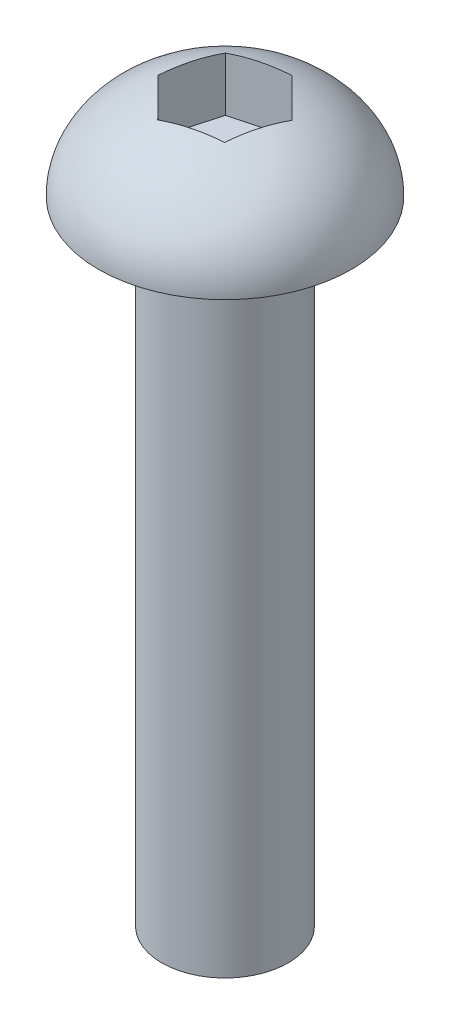
ISO-10303-21;
HEADER;
FILE_DESCRIPTION(('STEP AP214'),'2;1');
FILE_NAME('part.step','',(''),(''),'','','');
FILE_SCHEMA(('AUTOMOTIVE_DESIGN { 1 0 10303 214 1 1 1 1 }'));
ENDSEC;
DATA;
#1=APPLICATION_CONTEXT('core data for automotive mechanical design processes');
#2=APPLICATION_PROTOCOL_DEFINITION('international standard','automotive_design',2000,#1);
#3=PRODUCT_CONTEXT('',#1,'mechanical');
#4=PRODUCT('Part','Part','',(#3));
#5=PRODUCT_RELATED_PRODUCT_CATEGORY('part','',(#4));
#6=PRODUCT_DEFINITION_FORMATION('','',#4);
#7=PRODUCT_DEFINITION_CONTEXT('part definition',#1,'design');
#8=PRODUCT_DEFINITION('design','',#6,#7);
#9=PRODUCT_DEFINITION_SHAPE('','',#8);
#10=(LENGTH_UNIT() NAMED_UNIT(*) SI_UNIT(.MILLI.,.METRE.));
#11=(NAMED_UNIT(*) PLANE_ANGLE_UNIT() SI_UNIT($,.RADIAN.));
#12=(NAMED_UNIT(*) SI_UNIT($,.STERADIAN.) SOLID_ANGLE_UNIT());
#13=UNCERTAINTY_MEASURE_WITH_UNIT(LENGTH_MEASURE(1.E-05),#10,'distance_accuracy_value','');
#14=(GEOMETRIC_REPRESENTATION_CONTEXT(3) GLOBAL_UNCERTAINTY_ASSIGNED_CONTEXT((#13)) GLOBAL_UNIT_ASSIGNED_CONTEXT((#10,
#11,#12)) REPRESENTATION_CONTEXT('',''));
#15=CARTESIAN_POINT('',(0.,0.,0.));
#16=DIRECTION('',(0.,0.,1.));
#17=DIRECTION('',(1.,0.,0.));
#18=AXIS2_PLACEMENT_3D('',#15,#16,#17);
#19=CARTESIAN_POINT('',(0.,10.,0.));
#20=DIRECTION('',(0.,-1.,0.));
#21=DIRECTION('',(0.,0.,-1.));
#22=AXIS2_PLACEMENT_3D('',#19,#20,#21);
#23=CYLINDRICAL_SURFACE('',#22,1.);
#24=CARTESIAN_POINT('',(0.,10.,0.));
#25=DIRECTION('',(0.,1.,0.));
#26=DIRECTION('',(0.,0.,1.));
#27=AXIS2_PLACEMENT_3D('',#24,#25,#26);
#28=CIRCLE('',#27,1.);
#29=CARTESIAN_POINT('',(0.,10.,1.));
#30=VERTEX_POINT('',#29);
#31=EDGE_CURVE('E55',#30,#30,#28,.T.);
#32=ORIENTED_EDGE('',*,*,#31,.F.);
#33=EDGE_LOOP('',(#32));
#34=FACE_BOUND('',#33,.T.);
#35=CARTESIAN_POINT('',(0.,0.,0.));
#36=DIRECTION('',(0.,1.,0.));
#37=DIRECTION('',(0.,0.,1.));
#38=AXIS2_PLACEMENT_3D('',#35,#36,#37);
#39=CIRCLE('',#38,1.);
#40=CARTESIAN_POINT('',(0.,0.,1.));
#41=VERTEX_POINT('',#40);
#42=EDGE_CURVE('E131',#41,#41,#39,.T.);
#43=ORIENTED_EDGE('',*,*,#42,.T.);
#44=EDGE_LOOP('',(#43));
#45=FACE_BOUND('',#44,.T.);
#46=ADVANCED_FACE('F41',(#34,#45),#23,.T.);
#47=CARTESIAN_POINT('',(0.,0.,0.));
#48=DIRECTION('',(0.,1.,0.));
#49=DIRECTION('',(0.,0.,1.));
#50=AXIS2_PLACEMENT_3D('',#47,#48,#49);
#51=PLANE('',#50);
#52=ORIENTED_EDGE('',*,*,#42,.F.);
#53=EDGE_LOOP('',(#52));
#54=FACE_BOUND('',#53,.T.);
#55=ADVANCED_FACE('F226',(#54),#51,.F.);
#56=CARTESIAN_POINT('',(0.,10.,0.));
#57=DIRECTION('',(0.,1.,0.));
#58=DIRECTION('',(0.,0.,1.));
#59=AXIS2_PLACEMENT_3D('',#56,#57,#58);
#60=PLANE('',#59);
#61=ORIENTED_EDGE('',*,*,#31,.T.);
#62=EDGE_LOOP('',(#61));
#63=FACE_BOUND('',#62,.T.);
#64=CARTESIAN_POINT('',(0.,10.,0.));
#65=DIRECTION('',(0.,1.,0.));
#66=DIRECTION('',(0.,0.,1.));
#67=AXIS2_PLACEMENT_3D('',#64,#65,#66);
#68=CIRCLE('',#67,2.);
#69=CARTESIAN_POINT('',(0.,10.,2.));
#70=VERTEX_POINT('',#69);
#71=EDGE_CURVE('E162',#70,#70,#68,.T.);
#72=ORIENTED_EDGE('',*,*,#71,.F.);
#73=EDGE_LOOP('',(#72));
#74=FACE_BOUND('',#73,.T.);
#75=ADVANCED_FACE('F187',(#63,#74),#60,.F.);
#76=CARTESIAN_POINT('',(0.,10.,0.));
#77=DIRECTION('',(0.,0.,1.));
#78=DIRECTION('',(-1.,0.,0.));
#79=AXIS2_PLACEMENT_3D('',#76,#77,#78);
#80=ELLIPSE('',#79,2.,1.5);
#81=TRIMMED_CURVE('',#80,(PARAMETER_VALUE(4.71238898038469)),
(PARAMETER_VALUE(7.85398163397448)),.T.,.PARAMETER.);
#82=CARTESIAN_POINT('',(0.,11.5,0.));
#83=DIRECTION('',(0.,1.,0.));
#84=AXIS1_PLACEMENT('',#82,#83);
#85=SURFACE_OF_REVOLUTION('',#81,#84);
#86=ORIENTED_EDGE('',*,*,#71,.T.);
#87=EDGE_LOOP('',(#86));
#88=FACE_BOUND('',#87,.T.);
#89=CARTESIAN_POINT('',(0.609304591659922,11.352081728299,0.615424986966028));
#90=CARTESIAN_POINT('',(0.57453755722717,11.3585563051496,0.624554817769134));
#91=CARTESIAN_POINT('',(0.539627972913983,11.3642063000082,0.633722082201844));
#92=CARTESIAN_POINT('',(0.469803109231465,11.3738400397127,0.652058106590245));
#93=CARTESIAN_POINT('',(0.434889069533292,11.3778333837123,0.661226541008021));
#94=CARTESIAN_POINT('',(0.365060066435641,11.384200146652,0.679563652407737));
#95=CARTESIAN_POINT('',(0.330145632948055,11.386579794979,0.688732190234698));
#96=CARTESIAN_POINT('',(0.26031791416204,11.3897467739015,0.707068964373899));
#97=CARTESIAN_POINT('',(0.225404760744419,11.3905372163445,0.716237166054209));
#98=CARTESIAN_POINT('',(0.155578453909178,11.3905372163445,0.734573569414829));
#99=CARTESIAN_POINT('',(0.120665300491558,11.3897467739015,0.74374177109514));
#100=CARTESIAN_POINT('',(0.0508375817055423,11.386579794979,0.76207854523434));
#101=CARTESIAN_POINT('',(0.0159231482179561,11.384200146652,0.771247083061302));
#102=CARTESIAN_POINT('',(-0.0539058548796948,11.3778333837123,0.789584194461017));
#103=CARTESIAN_POINT('',(-0.0888198945778677,11.3738400397127,0.798752628878794));
#104=CARTESIAN_POINT('',(-0.158644758260386,11.3642063000082,0.817088653267195));
#105=CARTESIAN_POINT('',(-0.193554342573572,11.3585563051496,0.826255917699904));
#106=CARTESIAN_POINT('',(-0.228321377006325,11.352081728299,0.83538574850301));
#107=B_SPLINE_CURVE_WITH_KNOTS('',3,(#89,#90,#91,#92,#93,#94,#95,#96,#97,#98,#99,#100,#101,#102,
#103,#104,#105,#106),.UNSPECIFIED.,.F.,.F.,(4,2,2,2,2,2,2,2,4),(0.,0.109561480618325,
0.218478948684576,0.32697352940591,0.43525545757404,0.54353738574217,0.652031966463505,
0.760949434529756,0.870510915148081),.UNSPECIFIED.);
#108=CARTESIAN_POINT('',(0.609304591659922,11.352081728299,0.615424986966028));
#109=VERTEX_POINT('',#108);
#110=CARTESIAN_POINT('',(-0.228321377006325,11.352081728299,0.835385748503011));
#111=VERTEX_POINT('',#110);
#112=EDGE_CURVE('E100',#109,#111,#107,.T.);
#113=ORIENTED_EDGE('',*,*,#112,.T.);
#114=CARTESIAN_POINT('',(-0.228321377006325,11.352081728299,0.835385748503011));
#115=CARTESIAN_POINT('',(-0.253611559630445,11.3585563051496,0.809841528871551));
#116=CARTESIAN_POINT('',(-0.279005435668975,11.3642063000082,0.784192574237132));
#117=CARTESIAN_POINT('',(-0.329797330435001,11.3738400397127,0.732890480666487));
#118=CARTESIAN_POINT('',(-0.355194447402813,11.3778333837123,0.707238252548018));
#119=CARTESIAN_POINT('',(-0.405989353255817,11.384200146652,0.655933117644368));
#120=CARTESIAN_POINT('',(-0.431386756673317,11.386579794979,0.630280600198857));
#121=CARTESIAN_POINT('',(-0.48218072829433,11.3897467739015,0.578976408911453));
#122=CARTESIAN_POINT('',(-0.507577200565309,11.3905372163445,0.553324831965725));
#123=CARTESIAN_POINT('',(-0.558370145107265,11.3905372163445,0.502021678074269));
#124=CARTESIAN_POINT('',(-0.583766617378243,11.3897467739015,0.476370101128541));
#125=CARTESIAN_POINT('',(-0.634560588999256,11.386579794979,0.425065909841136));
#126=CARTESIAN_POINT('',(-0.659957992416756,11.384200146652,0.399413392395626));
#127=CARTESIAN_POINT('',(-0.710752898269761,11.3778333837123,0.348108257491975));
#128=CARTESIAN_POINT('',(-0.736150015237573,11.3738400397127,0.322456029373507));
#129=CARTESIAN_POINT('',(-0.786941910003598,11.3642063000082,0.271153935802862));
#130=CARTESIAN_POINT('',(-0.812335786042128,11.3585563051496,0.245504981168442));
#131=CARTESIAN_POINT('',(-0.837625968666248,11.352081728299,0.219960761536983));
#132=B_SPLINE_CURVE_WITH_KNOTS('',3,(#114,#115,#116,#117,#118,#119,#120,#121,#122,#123,#124,
#125,#126,#127,#128,#129,#130,#131),.UNSPECIFIED.,.F.,.F.,(4,2,2,2,2,2,2,2,4),(0.,
0.109561480618325,0.218478948684576,0.326973529405911,0.43525545757404,0.54353738574217,
0.652031966463505,0.760949434529756,0.870510915148081),.UNSPECIFIED.);
#133=CARTESIAN_POINT('',(-0.837625968666248,11.352081728299,0.219960761536983));
#134=VERTEX_POINT('',#133);
#135=EDGE_CURVE('E110',#111,#134,#132,.T.);
#136=ORIENTED_EDGE('',*,*,#135,.T.);
#137=CARTESIAN_POINT('',(-0.837625968666248,11.352081728299,0.219960761536983));
#138=CARTESIAN_POINT('',(-0.828149116857615,11.3585563051496,0.185286711102418));
#139=CARTESIAN_POINT('',(-0.818633408582958,11.3642063000082,0.150470492035289));
#140=CARTESIAN_POINT('',(-0.799600439666465,11.3738400397127,0.0808323740762418));
#141=CARTESIAN_POINT('',(-0.790083516936104,11.3778333837123,0.0460117115399975));
#142=CARTESIAN_POINT('',(-0.771049419691458,11.384200146652,-0.0236305347633683));
#143=CARTESIAN_POINT('',(-0.761532389621372,11.386579794979,-0.0584515900358408));
#144=CARTESIAN_POINT('',(-0.74249864245637,11.3897467739015,-0.128092555462446));
#145=CARTESIAN_POINT('',(-0.732981961309727,11.3905372163445,-0.162912334088484));
#146=CARTESIAN_POINT('',(-0.713948599016442,11.3905372163445,-0.23255189134056));
#147=CARTESIAN_POINT('',(-0.7044319178698,11.3897467739015,-0.267371669966598));
#148=CARTESIAN_POINT('',(-0.685398170704798,11.386579794979,-0.337012635393204));
#149=CARTESIAN_POINT('',(-0.675881140634712,11.384200146652,-0.371833690665676));
#150=CARTESIAN_POINT('',(-0.656847043390065,11.3778333837123,-0.441475936969042));
#151=CARTESIAN_POINT('',(-0.647330120659705,11.3738400397127,-0.476296599505286));
#152=CARTESIAN_POINT('',(-0.628297151743212,11.3642063000082,-0.545934717464333));
#153=CARTESIAN_POINT('',(-0.618781443468555,11.3585563051496,-0.580750936531462));
#154=CARTESIAN_POINT('',(-0.609304591659922,11.352081728299,-0.615424986966027));
#155=B_SPLINE_CURVE_WITH_KNOTS('',3,(#137,#138,#139,#140,#141,#142,#143,#144,#145,#146,#147,
#148,#149,#150,#151,#152,#153,#154),.UNSPECIFIED.,.F.,.F.,(4,2,2,2,2,2,2,2,4),(0.,
0.109561480618325,0.218478948684576,0.326973529405911,0.43525545757404,0.54353738574217,
0.652031966463505,0.760949434529756,0.870510915148081),.UNSPECIFIED.);
#156=CARTESIAN_POINT('',(-0.609304591659922,11.352081728299,-0.615424986966027));
#157=VERTEX_POINT('',#156);
#158=EDGE_CURVE('E166',#134,#157,#155,.T.);
#159=ORIENTED_EDGE('',*,*,#158,.T.);
#160=CARTESIAN_POINT('',(-0.609304591659922,11.352081728299,-0.615424986966027));
#161=CARTESIAN_POINT('',(-0.574537557227169,11.3585563051496,-0.624554817769134));
#162=CARTESIAN_POINT('',(-0.539627972913983,11.3642063000082,-0.633722082201843));
#163=CARTESIAN_POINT('',(-0.469803109231465,11.3738400397127,-0.652058106590245));
#164=CARTESIAN_POINT('',(-0.434889069533292,11.3778333837123,-0.661226541008021));
#165=CARTESIAN_POINT('',(-0.365060066435641,11.384200146652,-0.679563652407736));
#166=CARTESIAN_POINT('',(-0.330145632948055,11.386579794979,-0.688732190234698));
#167=CARTESIAN_POINT('',(-0.26031791416204,11.3897467739015,-0.707068964373899));
#168=CARTESIAN_POINT('',(-0.225404760744419,11.3905372163445,-0.716237166054209));
#169=CARTESIAN_POINT('',(-0.155578453909178,11.3905372163445,-0.734573569414829));
#170=CARTESIAN_POINT('',(-0.120665300491557,11.3897467739015,-0.743741771095139));
#171=CARTESIAN_POINT('',(-0.0508375817055421,11.386579794979,-0.76207854523434));
#172=CARTESIAN_POINT('',(-0.0159231482179561,11.384200146652,-0.771247083061302));
#173=CARTESIAN_POINT('',(0.0539058548796949,11.3778333837123,-0.789584194461017));
#174=CARTESIAN_POINT('',(0.0888198945778679,11.3738400397127,-0.798752628878793));
#175=CARTESIAN_POINT('',(0.158644758260386,11.3642063000082,-0.817088653267194));
#176=CARTESIAN_POINT('',(0.193554342573573,11.3585563051496,-0.826255917699904));
#177=CARTESIAN_POINT('',(0.228321377006325,11.352081728299,-0.83538574850301));
#178=B_SPLINE_CURVE_WITH_KNOTS('',3,(#160,#161,#162,#163,#164,#165,#166,#167,#168,#169,#170,
#171,#172,#173,#174,#175,#176,#177),.UNSPECIFIED.,.F.,.F.,(4,2,2,2,2,2,2,2,4),(0.,
0.109561480618325,0.218478948684576,0.32697352940591,0.43525545757404,0.54353738574217,
0.652031966463505,0.760949434529755,0.87051091514808),.UNSPECIFIED.);
#179=CARTESIAN_POINT('',(0.228321377006326,11.352081728299,-0.83538574850301));
#180=VERTEX_POINT('',#179);
#181=EDGE_CURVE('E153',#157,#180,#178,.T.);
#182=ORIENTED_EDGE('',*,*,#181,.T.);
#183=CARTESIAN_POINT('',(0.228321377006326,11.352081728299,-0.83538574850301));
#184=CARTESIAN_POINT('',(0.253611559630446,11.3585563051496,-0.809841528871551));
#185=CARTESIAN_POINT('',(0.279005435668975,11.3642063000082,-0.784192574237132));
#186=CARTESIAN_POINT('',(0.329797330435001,11.3738400397127,-0.732890480666487));
#187=CARTESIAN_POINT('',(0.355194447402813,11.3778333837123,-0.707238252548018));
#188=CARTESIAN_POINT('',(0.405989353255817,11.384200146652,-0.655933117644368));
#189=CARTESIAN_POINT('',(0.431386756673318,11.386579794979,-0.630280600198857));
#190=CARTESIAN_POINT('',(0.482180728294331,11.3897467739015,-0.578976408911453));
#191=CARTESIAN_POINT('',(0.507577200565309,11.3905372163445,-0.553324831965725));
#192=CARTESIAN_POINT('',(0.558370145107265,11.3905372163445,-0.502021678074269));
#193=CARTESIAN_POINT('',(0.583766617378243,11.3897467739015,-0.476370101128541));
#194=CARTESIAN_POINT('',(0.634560588999256,11.386579794979,-0.425065909841136));
#195=CARTESIAN_POINT('',(0.659957992416756,11.384200146652,-0.399413392395626));
#196=CARTESIAN_POINT('',(0.710752898269761,11.3778333837123,-0.348108257491975));
#197=CARTESIAN_POINT('',(0.736150015237573,11.3738400397127,-0.322456029373507));
#198=CARTESIAN_POINT('',(0.786941910003598,11.3642063000082,-0.271153935802862));
#199=CARTESIAN_POINT('',(0.812335786042128,11.3585563051496,-0.245504981168442));
#200=CARTESIAN_POINT('',(0.837625968666247,11.352081728299,-0.219960761536983));
#201=B_SPLINE_CURVE_WITH_KNOTS('',3,(#183,#184,#185,#186,#187,#188,#189,#190,#191,#192,#193,
#194,#195,#196,#197,#198,#199,#200),.UNSPECIFIED.,.F.,.F.,(4,2,2,2,2,2,2,2,4),(0.,
0.109561480618325,0.218478948684576,0.32697352940591,0.43525545757404,0.54353738574217,
0.652031966463505,0.760949434529756,0.870510915148081),.UNSPECIFIED.);
#202=CARTESIAN_POINT('',(0.837625968666248,11.352081728299,-0.219960761536983));
#203=VERTEX_POINT('',#202);
#204=EDGE_CURVE('E61',#180,#203,#201,.T.);
#205=ORIENTED_EDGE('',*,*,#204,.T.);
#206=CARTESIAN_POINT('',(0.837625968666248,11.352081728299,-0.219960761536983));
#207=CARTESIAN_POINT('',(0.828149116857615,11.3585563051496,-0.185286711102418));
#208=CARTESIAN_POINT('',(0.818633408582958,11.3642063000082,-0.150470492035289));
#209=CARTESIAN_POINT('',(0.799600439666466,11.3738400397127,-0.0808323740762417));
#210=CARTESIAN_POINT('',(0.790083516936105,11.3778333837123,-0.0460117115399974));
#211=CARTESIAN_POINT('',(0.771049419691458,11.384200146652,0.0236305347633685));
#212=CARTESIAN_POINT('',(0.761532389621372,11.386579794979,0.0584515900358409));
#213=CARTESIAN_POINT('',(0.74249864245637,11.3897467739015,0.128092555462446));
#214=CARTESIAN_POINT('',(0.732981961309728,11.3905372163445,0.162912334088484));
#215=CARTESIAN_POINT('',(0.713948599016443,11.3905372163445,0.23255189134056));
#216=CARTESIAN_POINT('',(0.7044319178698,11.3897467739015,0.267371669966598));
#217=CARTESIAN_POINT('',(0.685398170704798,11.386579794979,0.337012635393204));
#218=CARTESIAN_POINT('',(0.675881140634712,11.384200146652,0.371833690665676));
#219=CARTESIAN_POINT('',(0.656847043390066,11.3778333837123,0.441475936969042));
#220=CARTESIAN_POINT('',(0.647330120659705,11.3738400397127,0.476296599505286));
#221=CARTESIAN_POINT('',(0.628297151743212,11.3642063000082,0.545934717464333));
#222=CARTESIAN_POINT('',(0.618781443468555,11.3585563051496,0.580750936531462));
#223=CARTESIAN_POINT('',(0.609304591659922,11.352081728299,0.615424986966027));
#224=B_SPLINE_CURVE_WITH_KNOTS('',3,(#206,#207,#208,#209,#210,#211,#212,#213,#214,#215,#216,
#217,#218,#219,#220,#221,#222,#223),.UNSPECIFIED.,.F.,.F.,(4,2,2,2,2,2,2,2,4),(0.,
0.109561480618325,0.218478948684576,0.32697352940591,0.43525545757404,0.54353738574217,
0.652031966463505,0.760949434529755,0.870510915148081),.UNSPECIFIED.);
#225=EDGE_CURVE('E11',#203,#109,#224,.T.);
#226=ORIENTED_EDGE('',*,*,#225,.T.);
#227=EDGE_LOOP('',(#113,#136,#159,#182,#205,#226));
#228=FACE_BOUND('',#227,.T.);
#229=ADVANCED_FACE('F99',(#88,#228),#85,.F.);
#230=CARTESIAN_POINT('',(0.,10.5,0.));
#231=DIRECTION('',(0.,1.,0.));
#232=DIRECTION('',(0.,0.,1.));
#233=AXIS2_PLACEMENT_3D('',#230,#231,#232);
#234=PLANE('',#233);
#235=DIRECTION('',(0.967207156979359,0.,-0.253988809769064));
#236=VECTOR('',#235,1.);
#237=CARTESIAN_POINT('',(-0.228321377006325,10.5,0.835385748503011));
#238=LINE('',#237,#236);
#239=CARTESIAN_POINT('',(-0.228321377006325,10.5,0.835385748503011));
#240=VERTEX_POINT('',#239);
#241=CARTESIAN_POINT('',(0.609304591659922,10.5,0.615424986966028));
#242=VERTEX_POINT('',#241);
#243=EDGE_CURVE('E109',#240,#242,#238,.T.);
#244=ORIENTED_EDGE('',*,*,#243,.T.);
#245=DIRECTION('',(0.263642816952696,0.,-0.96462037355078));
#246=VECTOR('',#245,1.);
#247=CARTESIAN_POINT('',(0.609304591659922,10.5,0.615424986966028));
#248=LINE('',#247,#246);
#249=CARTESIAN_POINT('',(0.837625968666248,10.5,-0.219960761536983));
#250=VERTEX_POINT('',#249);
#251=EDGE_CURVE('E114',#242,#250,#248,.T.);
#252=ORIENTED_EDGE('',*,*,#251,.T.);
#253=DIRECTION('',(-0.703564340026662,0.,-0.710631563781716));
#254=VECTOR('',#253,1.);
#255=CARTESIAN_POINT('',(0.837625968666248,10.5,-0.219960761536983));
#256=LINE('',#255,#254);
#257=CARTESIAN_POINT('',(0.228321377006326,10.5,-0.835385748503011));
#258=VERTEX_POINT('',#257);
#259=EDGE_CURVE('E160',#250,#258,#256,.T.);
#260=ORIENTED_EDGE('',*,*,#259,.T.);
#261=DIRECTION('',(-0.967207156979359,0.,0.253988809769064));
#262=VECTOR('',#261,1.);
#263=CARTESIAN_POINT('',(0.228321377006326,10.5,-0.835385748503011));
#264=LINE('',#263,#262);
#265=CARTESIAN_POINT('',(-0.609304591659922,10.5,-0.615424986966028));
#266=VERTEX_POINT('',#265);
#267=EDGE_CURVE('E155',#258,#266,#264,.T.);
#268=ORIENTED_EDGE('',*,*,#267,.T.);
#269=DIRECTION('',(-0.263642816952696,0.,0.96462037355078));
#270=VECTOR('',#269,1.);
#271=CARTESIAN_POINT('',(-0.609304591659922,10.5,-0.615424986966028));
#272=LINE('',#271,#270);
#273=CARTESIAN_POINT('',(-0.837625968666248,10.5,0.219960761536983));
#274=VERTEX_POINT('',#273);
#275=EDGE_CURVE('E125',#266,#274,#272,.T.);
#276=ORIENTED_EDGE('',*,*,#275,.T.);
#277=DIRECTION('',(0.703564340026662,0.,0.710631563781716));
#278=VECTOR('',#277,1.);
#279=CARTESIAN_POINT('',(-0.837625968666248,10.5,0.219960761536983));
#280=LINE('',#279,#278);
#281=EDGE_CURVE('E118',#274,#240,#280,.T.);
#282=ORIENTED_EDGE('',*,*,#281,.T.);
#283=EDGE_LOOP('',(#244,#252,#260,#268,#276,#282));
#284=FACE_BOUND('',#283,.T.);
#285=ADVANCED_FACE('F186',(#284),#234,.T.);
#286=CARTESIAN_POINT('',(0.609304591659922,10.5,0.615424986966028));
#287=DIRECTION('',(0.96462037355078,0.,0.263642816952696));
#288=DIRECTION('',(0.263642816952696,0.,-0.964620373550781));
#289=AXIS2_PLACEMENT_3D('',#286,#287,#288);
#290=PLANE('',#289);
#291=ORIENTED_EDGE('',*,*,#225,.F.);
#292=DIRECTION('',(0.,1.,0.));
#293=VECTOR('',#292,1.);
#294=CARTESIAN_POINT('',(0.837625968666248,10.5,-0.219960761536983));
#295=LINE('',#294,#293);
#296=EDGE_CURVE('E117',#250,#203,#295,.T.);
#297=ORIENTED_EDGE('',*,*,#296,.F.);
#298=ORIENTED_EDGE('',*,*,#251,.F.);
#299=DIRECTION('',(0.,1.,0.));
#300=VECTOR('',#299,1.);
#301=CARTESIAN_POINT('',(0.609304591659922,10.5,0.615424986966028));
#302=LINE('',#301,#300);
#303=EDGE_CURVE('E106',#242,#109,#302,.T.);
#304=ORIENTED_EDGE('',*,*,#303,.T.);
#305=EDGE_LOOP('',(#291,#297,#298,#304));
#306=FACE_BOUND('',#305,.T.);
#307=ADVANCED_FACE('F112',(#306),#290,.F.);
#308=CARTESIAN_POINT('',(0.837625968666248,10.5,-0.219960761536983));
#309=DIRECTION('',(0.710631563781716,0.,-0.703564340026662));
#310=DIRECTION('',(-0.703564340026662,0.,-0.710631563781716));
#311=AXIS2_PLACEMENT_3D('',#308,#309,#310);
#312=PLANE('',#311);
#313=ORIENTED_EDGE('',*,*,#204,.F.);
#314=DIRECTION('',(0.,1.,0.));
#315=VECTOR('',#314,1.);
#316=CARTESIAN_POINT('',(0.228321377006326,10.5,-0.835385748503011));
#317=LINE('',#316,#315);
#318=EDGE_CURVE('E122',#258,#180,#317,.T.);
#319=ORIENTED_EDGE('',*,*,#318,.F.);
#320=ORIENTED_EDGE('',*,*,#259,.F.);
#321=ORIENTED_EDGE('',*,*,#296,.T.);
#322=EDGE_LOOP('',(#313,#319,#320,#321));
#323=FACE_BOUND('',#322,.T.);
#324=ADVANCED_FACE('F159',(#323),#312,.F.);
#325=CARTESIAN_POINT('',(0.228321377006326,10.5,-0.835385748503011));
#326=DIRECTION('',(-0.253988809769064,0.,-0.967207156979359));
#327=DIRECTION('',(-0.967207156979359,0.,0.253988809769064));
#328=AXIS2_PLACEMENT_3D('',#325,#326,#327);
#329=PLANE('',#328);
#330=ORIENTED_EDGE('',*,*,#181,.F.);
#331=DIRECTION('',(0.,1.,0.));
#332=VECTOR('',#331,1.);
#333=CARTESIAN_POINT('',(-0.609304591659922,10.5,-0.615424986966028));
#334=LINE('',#333,#332);
#335=EDGE_CURVE('E141',#266,#157,#334,.T.);
#336=ORIENTED_EDGE('',*,*,#335,.F.);
#337=ORIENTED_EDGE('',*,*,#267,.F.);
#338=ORIENTED_EDGE('',*,*,#318,.T.);
#339=EDGE_LOOP('',(#330,#336,#337,#338));
#340=FACE_BOUND('',#339,.T.);
#341=ADVANCED_FACE('F152',(#340),#329,.F.);
#342=CARTESIAN_POINT('',(-0.609304591659922,10.5,-0.615424986966028));
#343=DIRECTION('',(-0.96462037355078,0.,-0.263642816952696));
#344=DIRECTION('',(-0.263642816952696,0.,0.96462037355078));
#345=AXIS2_PLACEMENT_3D('',#342,#343,#344);
#346=PLANE('',#345);
#347=ORIENTED_EDGE('',*,*,#158,.F.);
#348=DIRECTION('',(0.,1.,0.));
#349=VECTOR('',#348,1.);
#350=CARTESIAN_POINT('',(-0.837625968666248,10.5,0.219960761536983));
#351=LINE('',#350,#349);
#352=EDGE_CURVE('E137',#274,#134,#351,.T.);
#353=ORIENTED_EDGE('',*,*,#352,.F.);
#354=ORIENTED_EDGE('',*,*,#275,.F.);
#355=ORIENTED_EDGE('',*,*,#335,.T.);
#356=EDGE_LOOP('',(#347,#353,#354,#355));
#357=FACE_BOUND('',#356,.T.);
#358=ADVANCED_FACE('F216',(#357),#346,.F.);
#359=CARTESIAN_POINT('',(-0.837625968666248,10.5,0.219960761536983));
#360=DIRECTION('',(-0.710631563781716,0.,0.703564340026662));
#361=DIRECTION('',(0.703564340026662,0.,0.710631563781716));
#362=AXIS2_PLACEMENT_3D('',#359,#360,#361);
#363=PLANE('',#362);
#364=ORIENTED_EDGE('',*,*,#135,.F.);
#365=DIRECTION('',(0.,1.,0.));
#366=VECTOR('',#365,1.);
#367=CARTESIAN_POINT('',(-0.228321377006325,10.5,0.835385748503011));
#368=LINE('',#367,#366);
#369=EDGE_CURVE('E69',#240,#111,#368,.T.);
#370=ORIENTED_EDGE('',*,*,#369,.F.);
#371=ORIENTED_EDGE('',*,*,#281,.F.);
#372=ORIENTED_EDGE('',*,*,#352,.T.);
#373=EDGE_LOOP('',(#364,#370,#371,#372));
#374=FACE_BOUND('',#373,.T.);
#375=ADVANCED_FACE('F213',(#374),#363,.F.);
#376=CARTESIAN_POINT('',(-0.228321377006325,10.5,0.835385748503011));
#377=DIRECTION('',(0.253988809769065,0.,0.967207156979359));
#378=DIRECTION('',(0.967207156979359,0.,-0.253988809769065));
#379=AXIS2_PLACEMENT_3D('',#376,#377,#378);
#380=PLANE('',#379);
#381=ORIENTED_EDGE('',*,*,#112,.F.);
#382=ORIENTED_EDGE('',*,*,#303,.F.);
#383=ORIENTED_EDGE('',*,*,#243,.F.);
#384=ORIENTED_EDGE('',*,*,#369,.T.);
#385=EDGE_LOOP('',(#381,#382,#383,#384));
#386=FACE_BOUND('',#385,.T.);
#387=ADVANCED_FACE('F105',(#386),#380,.F.);
#388=CLOSED_SHELL('',(#46,#55,#75,#229,#285,#307,#324,#341,#358,#375,#387));
#389=MANIFOLD_SOLID_BREP('B2',#388);
#390=ADVANCED_BREP_SHAPE_REPRESENTATION('',(#18,#389),#14);
#391=SHAPE_DEFINITION_REPRESENTATION(#9,#390);
ENDSEC;
END-ISO-10303-21;
